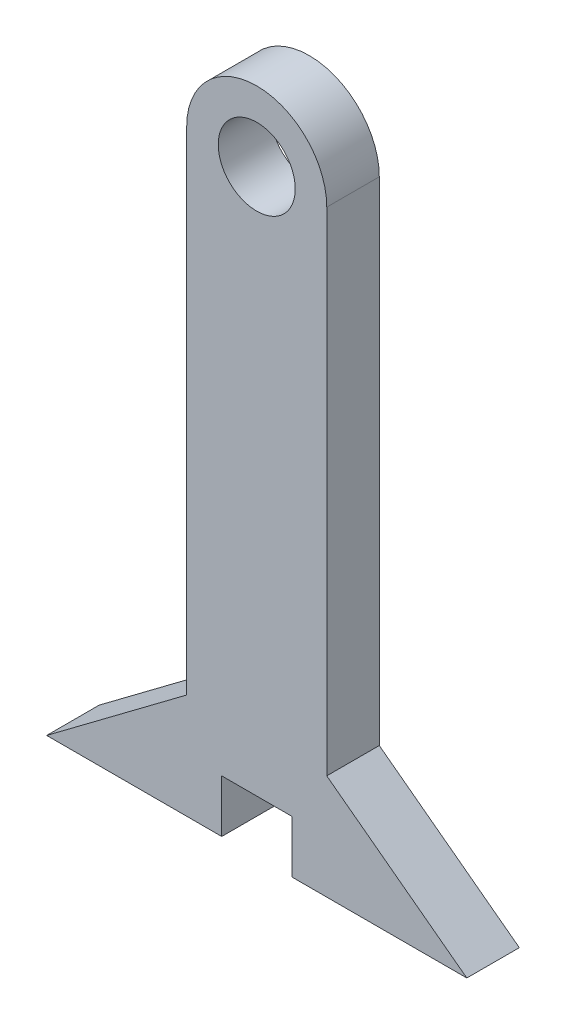
ISO-10303-21;
HEADER;
FILE_DESCRIPTION(('STEP AP214'),'2;1');
FILE_NAME('part.step','',(''),(''),'','','');
FILE_SCHEMA(('AUTOMOTIVE_DESIGN { 1 0 10303 214 1 1 1 1 }'));
ENDSEC;
DATA;
#1=APPLICATION_CONTEXT('core data for automotive mechanical design processes');
#2=APPLICATION_PROTOCOL_DEFINITION('international standard','automotive_design',2000,#1);
#3=PRODUCT_CONTEXT('',#1,'mechanical');
#4=PRODUCT('Part','Part','',(#3));
#5=PRODUCT_RELATED_PRODUCT_CATEGORY('part','',(#4));
#6=PRODUCT_DEFINITION_FORMATION('','',#4);
#7=PRODUCT_DEFINITION_CONTEXT('part definition',#1,'design');
#8=PRODUCT_DEFINITION('design','',#6,#7);
#9=PRODUCT_DEFINITION_SHAPE('','',#8);
#10=(LENGTH_UNIT() NAMED_UNIT(*) SI_UNIT(.MILLI.,.METRE.));
#11=(NAMED_UNIT(*) PLANE_ANGLE_UNIT() SI_UNIT($,.RADIAN.));
#12=(NAMED_UNIT(*) SI_UNIT($,.STERADIAN.) SOLID_ANGLE_UNIT());
#13=UNCERTAINTY_MEASURE_WITH_UNIT(LENGTH_MEASURE(1.E-05),#10,'distance_accuracy_value','');
#14=(GEOMETRIC_REPRESENTATION_CONTEXT(3) GLOBAL_UNCERTAINTY_ASSIGNED_CONTEXT((#13)) GLOBAL_UNIT_ASSIGNED_CONTEXT((#10,
#11,#12)) REPRESENTATION_CONTEXT('',''));
#15=CARTESIAN_POINT('',(0.,0.,0.));
#16=DIRECTION('',(0.,0.,1.));
#17=DIRECTION('',(1.,0.,0.));
#18=AXIS2_PLACEMENT_3D('',#15,#16,#17);
#19=CARTESIAN_POINT('',(0.,0.,7.5));
#20=DIRECTION('',(0.,1.,0.));
#21=DIRECTION('',(-1.,0.,0.));
#22=AXIS2_PLACEMENT_3D('',#19,#20,#21);
#23=PLANE('',#22);
#24=DIRECTION('',(1.,0.,0.));
#25=VECTOR('',#24,1.);
#26=CARTESIAN_POINT('',(0.,0.,7.5));
#27=LINE('',#26,#25);
#28=CARTESIAN_POINT('',(30.,0.,7.5));
#29=VERTEX_POINT('',#28);
#30=CARTESIAN_POINT('',(80.,0.,7.5));
#31=VERTEX_POINT('',#30);
#32=EDGE_CURVE('E205',#29,#31,#27,.T.);
#33=ORIENTED_EDGE('',*,*,#32,.F.);
#34=DIRECTION('',(0.,0.,-1.));
#35=VECTOR('',#34,1.);
#36=CARTESIAN_POINT('',(30.,0.,7.5));
#37=LINE('',#36,#35);
#38=CARTESIAN_POINT('',(30.,0.,-7.5));
#39=VERTEX_POINT('',#38);
#40=EDGE_CURVE('E11',#29,#39,#37,.T.);
#41=ORIENTED_EDGE('',*,*,#40,.T.);
#42=DIRECTION('',(1.,0.,0.));
#43=VECTOR('',#42,1.);
#44=CARTESIAN_POINT('',(0.,0.,-7.5));
#45=LINE('',#44,#43);
#46=CARTESIAN_POINT('',(80.,0.,-7.5));
#47=VERTEX_POINT('',#46);
#48=EDGE_CURVE('E133',#39,#47,#45,.T.);
#49=ORIENTED_EDGE('',*,*,#48,.T.);
#50=DIRECTION('',(0.,0.,1.));
#51=VECTOR('',#50,1.);
#52=CARTESIAN_POINT('',(80.,0.,-7.5));
#53=LINE('',#52,#51);
#54=EDGE_CURVE('E158',#47,#31,#53,.T.);
#55=ORIENTED_EDGE('',*,*,#54,.T.);
#56=EDGE_LOOP('',(#33,#41,#49,#55));
#57=FACE_BOUND('',#56,.T.);
#58=ADVANCED_FACE('F39',(#57),#23,.F.);
#59=CARTESIAN_POINT('',(20.,170.675,7.5));
#60=DIRECTION('',(0.,0.,1.));
#61=DIRECTION('',(1.,0.,0.));
#62=AXIS2_PLACEMENT_3D('',#59,#60,#61);
#63=PLANE('',#62);
#64=DIRECTION('',(0.,1.,0.));
#65=VECTOR('',#64,1.);
#66=CARTESIAN_POINT('',(30.,-15.,7.5));
#67=LINE('',#66,#65);
#68=CARTESIAN_POINT('',(30.,15.,7.5));
#69=VERTEX_POINT('',#68);
#70=EDGE_CURVE('E164',#29,#69,#67,.T.);
#71=ORIENTED_EDGE('',*,*,#70,.F.);
#72=ORIENTED_EDGE('',*,*,#32,.T.);
#73=DIRECTION('',(-0.8,0.6,0.));
#74=VECTOR('',#73,1.);
#75=CARTESIAN_POINT('',(40.,30.,7.5));
#76=LINE('',#75,#74);
#77=CARTESIAN_POINT('',(40.,30.,7.5));
#78=VERTEX_POINT('',#77);
#79=EDGE_CURVE('E55',#31,#78,#76,.T.);
#80=ORIENTED_EDGE('',*,*,#79,.T.);
#81=DIRECTION('',(0.,1.,0.));
#82=VECTOR('',#81,1.);
#83=CARTESIAN_POINT('',(40.,0.,7.5));
#84=LINE('',#83,#82);
#85=CARTESIAN_POINT('',(40.,170.675,7.5));
#86=VERTEX_POINT('',#85);
#87=EDGE_CURVE('E209',#78,#86,#84,.T.);
#88=ORIENTED_EDGE('',*,*,#87,.T.);
#89=CARTESIAN_POINT('',(20.,170.675,7.5));
#90=DIRECTION('',(0.,0.,1.));
#91=DIRECTION('',(1.,0.,0.));
#92=AXIS2_PLACEMENT_3D('',#89,#90,#91);
#93=CIRCLE('',#92,20.);
#94=CARTESIAN_POINT('',(0.,170.675,7.5));
#95=VERTEX_POINT('',#94);
#96=EDGE_CURVE('E212',#86,#95,#93,.T.);
#97=ORIENTED_EDGE('',*,*,#96,.T.);
#98=DIRECTION('',(0.,-1.,0.));
#99=VECTOR('',#98,1.);
#100=CARTESIAN_POINT('',(0.,0.,7.5));
#101=LINE('',#100,#99);
#102=CARTESIAN_POINT('',(0.,30.,7.5));
#103=VERTEX_POINT('',#102);
#104=EDGE_CURVE('E201',#95,#103,#101,.T.);
#105=ORIENTED_EDGE('',*,*,#104,.T.);
#106=DIRECTION('',(-0.8,-0.6,0.));
#107=VECTOR('',#106,1.);
#108=CARTESIAN_POINT('',(0.,30.,7.5));
#109=LINE('',#108,#107);
#110=CARTESIAN_POINT('',(-40.,0.,7.5));
#111=VERTEX_POINT('',#110);
#112=EDGE_CURVE('E148',#103,#111,#109,.T.);
#113=ORIENTED_EDGE('',*,*,#112,.T.);
#114=CARTESIAN_POINT('',(10.,0.,7.5));
#115=VERTEX_POINT('',#114);
#116=EDGE_CURVE('E139',#111,#115,#27,.T.);
#117=ORIENTED_EDGE('',*,*,#116,.T.);
#118=DIRECTION('',(0.,-1.,0.));
#119=VECTOR('',#118,1.);
#120=CARTESIAN_POINT('',(10.,-15.,7.5));
#121=LINE('',#120,#119);
#122=CARTESIAN_POINT('',(10.,15.,7.5));
#123=VERTEX_POINT('',#122);
#124=EDGE_CURVE('E63',#123,#115,#121,.T.);
#125=ORIENTED_EDGE('',*,*,#124,.F.);
#126=DIRECTION('',(-1.,0.,0.));
#127=VECTOR('',#126,1.);
#128=CARTESIAN_POINT('',(10.,15.,7.5));
#129=LINE('',#128,#127);
#130=EDGE_CURVE('E180',#69,#123,#129,.T.);
#131=ORIENTED_EDGE('',*,*,#130,.F.);
#132=EDGE_LOOP('',(#71,#72,#80,#88,#97,#105,#113,#117,#125,#131));
#133=FACE_BOUND('',#132,.T.);
#134=CARTESIAN_POINT('',(20.,170.675,7.5));
#135=DIRECTION('',(0.,0.,1.));
#136=DIRECTION('',(1.,0.,0.));
#137=AXIS2_PLACEMENT_3D('',#134,#135,#136);
#138=CIRCLE('',#137,11.);
#139=CARTESIAN_POINT('',(31.,170.675,7.5));
#140=VERTEX_POINT('',#139);
#141=EDGE_CURVE('E193',#140,#140,#138,.T.);
#142=ORIENTED_EDGE('',*,*,#141,.F.);
#143=EDGE_LOOP('',(#142));
#144=FACE_BOUND('',#143,.T.);
#145=ADVANCED_FACE('F230',(#133,#144),#63,.T.);
#146=CARTESIAN_POINT('',(20.,170.675,-7.5));
#147=DIRECTION('',(0.,0.,1.));
#148=DIRECTION('',(1.,0.,0.));
#149=AXIS2_PLACEMENT_3D('',#146,#147,#148);
#150=PLANE('',#149);
#151=ORIENTED_EDGE('',*,*,#48,.F.);
#152=DIRECTION('',(0.,1.,0.));
#153=VECTOR('',#152,1.);
#154=CARTESIAN_POINT('',(30.,-15.,-7.5));
#155=LINE('',#154,#153);
#156=CARTESIAN_POINT('',(30.,15.,-7.5));
#157=VERTEX_POINT('',#156);
#158=EDGE_CURVE('E168',#39,#157,#155,.T.);
#159=ORIENTED_EDGE('',*,*,#158,.T.);
#160=DIRECTION('',(-1.,0.,0.));
#161=VECTOR('',#160,1.);
#162=CARTESIAN_POINT('',(10.,15.,-7.5));
#163=LINE('',#162,#161);
#164=CARTESIAN_POINT('',(10.,15.,-7.5));
#165=VERTEX_POINT('',#164);
#166=EDGE_CURVE('E172',#157,#165,#163,.T.);
#167=ORIENTED_EDGE('',*,*,#166,.T.);
#168=DIRECTION('',(0.,-1.,0.));
#169=VECTOR('',#168,1.);
#170=CARTESIAN_POINT('',(10.,-15.,-7.5));
#171=LINE('',#170,#169);
#172=CARTESIAN_POINT('',(10.,0.,-7.5));
#173=VERTEX_POINT('',#172);
#174=EDGE_CURVE('E129',#165,#173,#171,.T.);
#175=ORIENTED_EDGE('',*,*,#174,.T.);
#176=CARTESIAN_POINT('',(-40.,0.,-7.5));
#177=VERTEX_POINT('',#176);
#178=EDGE_CURVE('E118',#177,#173,#45,.T.);
#179=ORIENTED_EDGE('',*,*,#178,.F.);
#180=DIRECTION('',(-0.8,-0.6,0.));
#181=VECTOR('',#180,1.);
#182=CARTESIAN_POINT('',(0.,30.,-7.5));
#183=LINE('',#182,#181);
#184=CARTESIAN_POINT('',(0.,30.,-7.5));
#185=VERTEX_POINT('',#184);
#186=EDGE_CURVE('E125',#185,#177,#183,.T.);
#187=ORIENTED_EDGE('',*,*,#186,.F.);
#188=DIRECTION('',(0.,-1.,0.));
#189=VECTOR('',#188,1.);
#190=CARTESIAN_POINT('',(0.,0.,-7.5));
#191=LINE('',#190,#189);
#192=CARTESIAN_POINT('',(0.,170.675,-7.5));
#193=VERTEX_POINT('',#192);
#194=EDGE_CURVE('E197',#193,#185,#191,.T.);
#195=ORIENTED_EDGE('',*,*,#194,.F.);
#196=CARTESIAN_POINT('',(20.,170.675,-7.5));
#197=DIRECTION('',(0.,0.,1.));
#198=DIRECTION('',(1.,0.,0.));
#199=AXIS2_PLACEMENT_3D('',#196,#197,#198);
#200=CIRCLE('',#199,20.);
#201=CARTESIAN_POINT('',(40.,170.675,-7.5));
#202=VERTEX_POINT('',#201);
#203=EDGE_CURVE('E206',#202,#193,#200,.T.);
#204=ORIENTED_EDGE('',*,*,#203,.F.);
#205=DIRECTION('',(0.,1.,0.));
#206=VECTOR('',#205,1.);
#207=CARTESIAN_POINT('',(40.,0.,-7.5));
#208=LINE('',#207,#206);
#209=CARTESIAN_POINT('',(40.,30.,-7.5));
#210=VERTEX_POINT('',#209);
#211=EDGE_CURVE('E132',#210,#202,#208,.T.);
#212=ORIENTED_EDGE('',*,*,#211,.F.);
#213=DIRECTION('',(-0.8,0.6,0.));
#214=VECTOR('',#213,1.);
#215=CARTESIAN_POINT('',(40.,30.,-7.5));
#216=LINE('',#215,#214);
#217=EDGE_CURVE('E155',#47,#210,#216,.T.);
#218=ORIENTED_EDGE('',*,*,#217,.F.);
#219=EDGE_LOOP('',(#151,#159,#167,#175,#179,#187,#195,#204,#212,#218));
#220=FACE_BOUND('',#219,.T.);
#221=CARTESIAN_POINT('',(20.,170.675,-7.5));
#222=DIRECTION('',(0.,0.,1.));
#223=DIRECTION('',(1.,0.,0.));
#224=AXIS2_PLACEMENT_3D('',#221,#222,#223);
#225=CIRCLE('',#224,11.);
#226=CARTESIAN_POINT('',(31.,170.675,-7.5));
#227=VERTEX_POINT('',#226);
#228=EDGE_CURVE('E189',#227,#227,#225,.T.);
#229=ORIENTED_EDGE('',*,*,#228,.T.);
#230=EDGE_LOOP('',(#229));
#231=FACE_BOUND('',#230,.T.);
#232=ADVANCED_FACE('F121',(#220,#231),#150,.F.);
#233=CARTESIAN_POINT('',(0.,0.,7.5));
#234=DIRECTION('',(1.,0.,0.));
#235=DIRECTION('',(0.,0.,-1.));
#236=AXIS2_PLACEMENT_3D('',#233,#234,#235);
#237=PLANE('',#236);
#238=ORIENTED_EDGE('',*,*,#194,.T.);
#239=DIRECTION('',(0.,0.,1.));
#240=VECTOR('',#239,1.);
#241=CARTESIAN_POINT('',(0.,30.,-7.5));
#242=LINE('',#241,#240);
#243=EDGE_CURVE('E143',#185,#103,#242,.T.);
#244=ORIENTED_EDGE('',*,*,#243,.T.);
#245=ORIENTED_EDGE('',*,*,#104,.F.);
#246=DIRECTION('',(0.,0.,-1.));
#247=VECTOR('',#246,1.);
#248=CARTESIAN_POINT('',(0.,170.675,7.5));
#249=LINE('',#248,#247);
#250=EDGE_CURVE('E215',#95,#193,#249,.T.);
#251=ORIENTED_EDGE('',*,*,#250,.T.);
#252=EDGE_LOOP('',(#238,#244,#245,#251));
#253=FACE_BOUND('',#252,.T.);
#254=ADVANCED_FACE('F41',(#253),#237,.F.);
#255=ORIENTED_EDGE('',*,*,#178,.T.);
#256=DIRECTION('',(0.,0.,1.));
#257=VECTOR('',#256,1.);
#258=CARTESIAN_POINT('',(10.,0.,7.5));
#259=LINE('',#258,#257);
#260=EDGE_CURVE('E48',#173,#115,#259,.T.);
#261=ORIENTED_EDGE('',*,*,#260,.T.);
#262=ORIENTED_EDGE('',*,*,#116,.F.);
#263=DIRECTION('',(0.,0.,1.));
#264=VECTOR('',#263,1.);
#265=CARTESIAN_POINT('',(-40.,0.,-7.5));
#266=LINE('',#265,#264);
#267=EDGE_CURVE('E136',#177,#111,#266,.T.);
#268=ORIENTED_EDGE('',*,*,#267,.F.);
#269=EDGE_LOOP('',(#255,#261,#262,#268));
#270=FACE_BOUND('',#269,.T.);
#271=ADVANCED_FACE('F137',(#270),#23,.F.);
#272=CARTESIAN_POINT('',(40.,0.,7.5));
#273=DIRECTION('',(-1.,0.,0.));
#274=DIRECTION('',(0.,-1.,0.));
#275=AXIS2_PLACEMENT_3D('',#272,#273,#274);
#276=PLANE('',#275);
#277=ORIENTED_EDGE('',*,*,#87,.F.);
#278=DIRECTION('',(0.,0.,1.));
#279=VECTOR('',#278,1.);
#280=CARTESIAN_POINT('',(40.,30.,-7.5));
#281=LINE('',#280,#279);
#282=EDGE_CURVE('E161',#210,#78,#281,.T.);
#283=ORIENTED_EDGE('',*,*,#282,.F.);
#284=ORIENTED_EDGE('',*,*,#211,.T.);
#285=DIRECTION('',(0.,0.,-1.));
#286=VECTOR('',#285,1.);
#287=CARTESIAN_POINT('',(40.,170.675,7.5));
#288=LINE('',#287,#286);
#289=EDGE_CURVE('E225',#86,#202,#288,.T.);
#290=ORIENTED_EDGE('',*,*,#289,.F.);
#291=EDGE_LOOP('',(#277,#283,#284,#290));
#292=FACE_BOUND('',#291,.T.);
#293=ADVANCED_FACE('F245',(#292),#276,.F.);
#294=CARTESIAN_POINT('',(20.,170.675,7.5));
#295=DIRECTION('',(0.,0.,-1.));
#296=DIRECTION('',(-1.,0.,0.));
#297=AXIS2_PLACEMENT_3D('',#294,#295,#296);
#298=CYLINDRICAL_SURFACE('',#297,20.);
#299=ORIENTED_EDGE('',*,*,#203,.T.);
#300=ORIENTED_EDGE('',*,*,#250,.F.);
#301=ORIENTED_EDGE('',*,*,#96,.F.);
#302=ORIENTED_EDGE('',*,*,#289,.T.);
#303=EDGE_LOOP('',(#299,#300,#301,#302));
#304=FACE_BOUND('',#303,.T.);
#305=ADVANCED_FACE('F240',(#304),#298,.T.);
#306=CARTESIAN_POINT('',(20.,170.675,7.5));
#307=DIRECTION('',(0.,0.,-1.));
#308=DIRECTION('',(-1.,0.,0.));
#309=AXIS2_PLACEMENT_3D('',#306,#307,#308);
#310=CYLINDRICAL_SURFACE('',#309,11.);
#311=ORIENTED_EDGE('',*,*,#141,.T.);
#312=EDGE_LOOP('',(#311));
#313=FACE_BOUND('',#312,.T.);
#314=ORIENTED_EDGE('',*,*,#228,.F.);
#315=EDGE_LOOP('',(#314));
#316=FACE_BOUND('',#315,.T.);
#317=ADVANCED_FACE('F274',(#313,#316),#310,.F.);
#318=CARTESIAN_POINT('',(30.,-15.,-7.5));
#319=DIRECTION('',(1.,0.,0.));
#320=DIRECTION('',(0.,0.,-1.));
#321=AXIS2_PLACEMENT_3D('',#318,#319,#320);
#322=PLANE('',#321);
#323=ORIENTED_EDGE('',*,*,#70,.T.);
#324=DIRECTION('',(0.,0.,1.));
#325=VECTOR('',#324,1.);
#326=CARTESIAN_POINT('',(30.,15.,-7.5));
#327=LINE('',#326,#325);
#328=EDGE_CURVE('E177',#157,#69,#327,.T.);
#329=ORIENTED_EDGE('',*,*,#328,.F.);
#330=ORIENTED_EDGE('',*,*,#158,.F.);
#331=ORIENTED_EDGE('',*,*,#40,.F.);
#332=EDGE_LOOP('',(#323,#329,#330,#331));
#333=FACE_BOUND('',#332,.T.);
#334=ADVANCED_FACE('F278',(#333),#322,.F.);
#335=CARTESIAN_POINT('',(10.,-15.,-7.5));
#336=DIRECTION('',(-1.,0.,0.));
#337=DIRECTION('',(0.,0.,1.));
#338=AXIS2_PLACEMENT_3D('',#335,#336,#337);
#339=PLANE('',#338);
#340=ORIENTED_EDGE('',*,*,#174,.F.);
#341=DIRECTION('',(0.,0.,1.));
#342=VECTOR('',#341,1.);
#343=CARTESIAN_POINT('',(10.,15.,-7.5));
#344=LINE('',#343,#342);
#345=EDGE_CURVE('E186',#165,#123,#344,.T.);
#346=ORIENTED_EDGE('',*,*,#345,.T.);
#347=ORIENTED_EDGE('',*,*,#124,.T.);
#348=ORIENTED_EDGE('',*,*,#260,.F.);
#349=EDGE_LOOP('',(#340,#346,#347,#348));
#350=FACE_BOUND('',#349,.T.);
#351=ADVANCED_FACE('F283',(#350),#339,.F.);
#352=CARTESIAN_POINT('',(10.,15.,-7.5));
#353=DIRECTION('',(0.,1.,0.));
#354=DIRECTION('',(0.,0.,1.));
#355=AXIS2_PLACEMENT_3D('',#352,#353,#354);
#356=PLANE('',#355);
#357=ORIENTED_EDGE('',*,*,#130,.T.);
#358=ORIENTED_EDGE('',*,*,#345,.F.);
#359=ORIENTED_EDGE('',*,*,#166,.F.);
#360=ORIENTED_EDGE('',*,*,#328,.T.);
#361=EDGE_LOOP('',(#357,#358,#359,#360));
#362=FACE_BOUND('',#361,.T.);
#363=ADVANCED_FACE('F288',(#362),#356,.F.);
#364=CARTESIAN_POINT('',(40.,30.,-7.5));
#365=DIRECTION('',(0.6,0.8,0.));
#366=DIRECTION('',(-0.8,0.6,0.));
#367=AXIS2_PLACEMENT_3D('',#364,#365,#366);
#368=PLANE('',#367);
#369=ORIENTED_EDGE('',*,*,#79,.F.);
#370=ORIENTED_EDGE('',*,*,#54,.F.);
#371=ORIENTED_EDGE('',*,*,#217,.T.);
#372=ORIENTED_EDGE('',*,*,#282,.T.);
#373=EDGE_LOOP('',(#369,#370,#371,#372));
#374=FACE_BOUND('',#373,.T.);
#375=ADVANCED_FACE('F248',(#374),#368,.T.);
#376=CARTESIAN_POINT('',(0.,30.,-7.5));
#377=DIRECTION('',(-0.6,0.8,0.));
#378=DIRECTION('',(-0.8,-0.6,0.));
#379=AXIS2_PLACEMENT_3D('',#376,#377,#378);
#380=PLANE('',#379);
#381=ORIENTED_EDGE('',*,*,#112,.F.);
#382=ORIENTED_EDGE('',*,*,#243,.F.);
#383=ORIENTED_EDGE('',*,*,#186,.T.);
#384=ORIENTED_EDGE('',*,*,#267,.T.);
#385=EDGE_LOOP('',(#381,#382,#383,#384));
#386=FACE_BOUND('',#385,.T.);
#387=ADVANCED_FACE('F145',(#386),#380,.T.);
#388=CLOSED_SHELL('',(#58,#145,#232,#254,#271,#293,#305,#317,#334,#351,#363,#375,#387));
#389=MANIFOLD_SOLID_BREP('B2',#388);
#390=ADVANCED_BREP_SHAPE_REPRESENTATION('',(#18,#389),#14);
#391=SHAPE_DEFINITION_REPRESENTATION(#9,#390);
ENDSEC;
END-ISO-10303-21;
